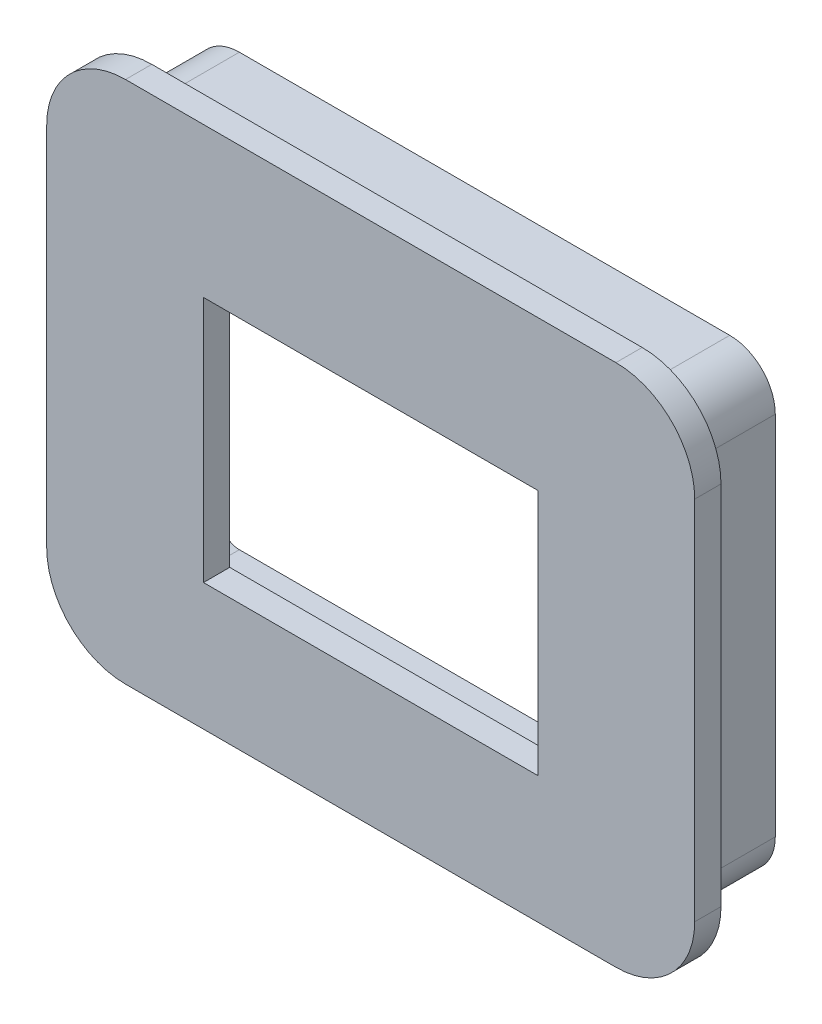
ISO-10303-21;
HEADER;
FILE_DESCRIPTION(('STEP AP214'),'2;1');
FILE_NAME('part.step','',(''),(''),'','','');
FILE_SCHEMA(('AUTOMOTIVE_DESIGN { 1 0 10303 214 1 1 1 1 }'));
ENDSEC;
DATA;
#1=APPLICATION_CONTEXT('core data for automotive mechanical design processes');
#2=APPLICATION_PROTOCOL_DEFINITION('international standard','automotive_design',2000,#1);
#3=PRODUCT_CONTEXT('',#1,'mechanical');
#4=PRODUCT('Part','Part','',(#3));
#5=PRODUCT_RELATED_PRODUCT_CATEGORY('part','',(#4));
#6=PRODUCT_DEFINITION_FORMATION('','',#4);
#7=PRODUCT_DEFINITION_CONTEXT('part definition',#1,'design');
#8=PRODUCT_DEFINITION('design','',#6,#7);
#9=PRODUCT_DEFINITION_SHAPE('','',#8);
#10=(LENGTH_UNIT() NAMED_UNIT(*) SI_UNIT(.MILLI.,.METRE.));
#11=(NAMED_UNIT(*) PLANE_ANGLE_UNIT() SI_UNIT($,.RADIAN.));
#12=(NAMED_UNIT(*) SI_UNIT($,.STERADIAN.) SOLID_ANGLE_UNIT());
#13=UNCERTAINTY_MEASURE_WITH_UNIT(LENGTH_MEASURE(1.E-05),#10,'distance_accuracy_value','');
#14=(GEOMETRIC_REPRESENTATION_CONTEXT(3) GLOBAL_UNCERTAINTY_ASSIGNED_CONTEXT((#13)) GLOBAL_UNIT_ASSIGNED_CONTEXT((#10,
#11,#12)) REPRESENTATION_CONTEXT('',''));
#15=CARTESIAN_POINT('',(0.,0.,0.));
#16=DIRECTION('',(0.,0.,1.));
#17=DIRECTION('',(1.,0.,0.));
#18=AXIS2_PLACEMENT_3D('',#15,#16,#17);
#19=CARTESIAN_POINT('',(-25.2326550947052,21.0000000000001,-5.));
#20=DIRECTION('',(0.,1.,0.));
#21=DIRECTION('',(0.,0.,1.));
#22=AXIS2_PLACEMENT_3D('',#19,#20,#21);
#23=PLANE('',#22);
#24=DIRECTION('',(-1.,0.,0.));
#25=VECTOR('',#24,1.);
#26=CARTESIAN_POINT('',(-25.2326550947052,21.0000000000001,0.));
#27=LINE('',#26,#25);
#28=CARTESIAN_POINT('',(-6.24500451351651E-13,21.0000000000001,0.));
#29=VERTEX_POINT('',#28);
#30=CARTESIAN_POINT('',(-28.0000000000006,21.0000000000001,0.));
#31=VERTEX_POINT('',#30);
#32=EDGE_CURVE('E235',#29,#31,#27,.T.);
#33=ORIENTED_EDGE('',*,*,#32,.F.);
#34=DIRECTION('',(0.,0.,1.));
#35=VECTOR('',#34,1.);
#36=CARTESIAN_POINT('',(-6.24500451351651E-13,21.0000000000001,-5.));
#37=LINE('',#36,#35);
#38=CARTESIAN_POINT('',(-6.24500451351651E-13,21.0000000000001,-5.));
#39=VERTEX_POINT('',#38);
#40=EDGE_CURVE('E12',#39,#29,#37,.T.);
#41=ORIENTED_EDGE('',*,*,#40,.F.);
#42=DIRECTION('',(-1.,0.,0.));
#43=VECTOR('',#42,1.);
#44=CARTESIAN_POINT('',(-25.2326550947052,21.0000000000001,-5.));
#45=LINE('',#44,#43);
#46=CARTESIAN_POINT('',(-28.0000000000006,21.0000000000001,-5.));
#47=VERTEX_POINT('',#46);
#48=EDGE_CURVE('E231',#39,#47,#45,.T.);
#49=ORIENTED_EDGE('',*,*,#48,.T.);
#50=DIRECTION('',(0.,0.,1.));
#51=VECTOR('',#50,1.);
#52=CARTESIAN_POINT('',(-28.0000000000006,21.0000000000001,-5.));
#53=LINE('',#52,#51);
#54=EDGE_CURVE('E51',#47,#31,#53,.T.);
#55=ORIENTED_EDGE('',*,*,#54,.T.);
#56=EDGE_LOOP('',(#33,#41,#49,#55));
#57=FACE_BOUND('',#56,.T.);
#58=ADVANCED_FACE('F47',(#57),#23,.T.);
#59=CARTESIAN_POINT('',(-6.1409211049579E-13,18.4000000000001,-5.));
#60=DIRECTION('',(0.,0.,1.));
#61=DIRECTION('',(1.,0.,0.));
#62=AXIS2_PLACEMENT_3D('',#59,#60,#61);
#63=CYLINDRICAL_SURFACE('',#62,2.6);
#64=CARTESIAN_POINT('',(-6.1409211049579E-13,18.4000000000001,0.));
#65=DIRECTION('',(0.,0.,1.));
#66=DIRECTION('',(1.,0.,0.));
#67=AXIS2_PLACEMENT_3D('',#64,#65,#66);
#68=CIRCLE('',#67,2.6);
#69=CARTESIAN_POINT('',(2.59999999999939,18.4000000000001,0.));
#70=VERTEX_POINT('',#69);
#71=EDGE_CURVE('E273',#70,#29,#68,.T.);
#72=ORIENTED_EDGE('',*,*,#71,.F.);
#73=DIRECTION('',(0.,0.,1.));
#74=VECTOR('',#73,1.);
#75=CARTESIAN_POINT('',(2.59999999999939,18.4000000000001,-5.));
#76=LINE('',#75,#74);
#77=CARTESIAN_POINT('',(2.59999999999939,18.4000000000001,-5.));
#78=VERTEX_POINT('',#77);
#79=EDGE_CURVE('E56',#78,#70,#76,.T.);
#80=ORIENTED_EDGE('',*,*,#79,.F.);
#81=CARTESIAN_POINT('',(-6.1409211049579E-13,18.4000000000001,-5.));
#82=DIRECTION('',(0.,0.,1.));
#83=DIRECTION('',(1.,0.,0.));
#84=AXIS2_PLACEMENT_3D('',#81,#82,#83);
#85=CIRCLE('',#84,2.6);
#86=EDGE_CURVE('E253',#78,#39,#85,.T.);
#87=ORIENTED_EDGE('',*,*,#86,.T.);
#88=ORIENTED_EDGE('',*,*,#40,.T.);
#89=EDGE_LOOP('',(#72,#80,#87,#88));
#90=FACE_BOUND('',#89,.T.);
#91=ADVANCED_FACE('F298',(#90),#63,.T.);
#92=CARTESIAN_POINT('',(2.59999999999938,-2.49999999999988,-5.));
#93=DIRECTION('',(1.,0.,0.));
#94=DIRECTION('',(0.,1.,0.));
#95=AXIS2_PLACEMENT_3D('',#92,#93,#94);
#96=PLANE('',#95);
#97=DIRECTION('',(0.,1.,0.));
#98=VECTOR('',#97,1.);
#99=CARTESIAN_POINT('',(2.59999999999938,-2.49999999999988,0.));
#100=LINE('',#99,#98);
#101=CARTESIAN_POINT('',(2.59999999999938,-2.49999999999988,0.));
#102=VERTEX_POINT('',#101);
#103=EDGE_CURVE('E270',#102,#70,#100,.T.);
#104=ORIENTED_EDGE('',*,*,#103,.F.);
#105=DIRECTION('',(0.,0.,1.));
#106=VECTOR('',#105,1.);
#107=CARTESIAN_POINT('',(2.59999999999938,-2.49999999999988,-5.));
#108=LINE('',#107,#106);
#109=CARTESIAN_POINT('',(2.59999999999938,-2.49999999999988,-5.));
#110=VERTEX_POINT('',#109);
#111=EDGE_CURVE('E278',#110,#102,#108,.T.);
#112=ORIENTED_EDGE('',*,*,#111,.F.);
#113=DIRECTION('',(0.,1.,0.));
#114=VECTOR('',#113,1.);
#115=CARTESIAN_POINT('',(2.59999999999938,-2.49999999999988,-5.));
#116=LINE('',#115,#114);
#117=EDGE_CURVE('E250',#110,#78,#116,.T.);
#118=ORIENTED_EDGE('',*,*,#117,.T.);
#119=ORIENTED_EDGE('',*,*,#79,.T.);
#120=EDGE_LOOP('',(#104,#112,#118,#119));
#121=FACE_BOUND('',#120,.T.);
#122=ADVANCED_FACE('F303',(#121),#96,.T.);
#123=CARTESIAN_POINT('',(-6.17561557447743E-13,-2.49999999999988,-5.));
#124=DIRECTION('',(0.,0.,1.));
#125=DIRECTION('',(1.,0.,0.));
#126=AXIS2_PLACEMENT_3D('',#123,#124,#125);
#127=CYLINDRICAL_SURFACE('',#126,2.6);
#128=CARTESIAN_POINT('',(-6.17561557447743E-13,-2.49999999999988,0.));
#129=DIRECTION('',(0.,0.,1.));
#130=DIRECTION('',(1.,0.,0.));
#131=AXIS2_PLACEMENT_3D('',#128,#129,#130);
#132=CIRCLE('',#131,2.6);
#133=CARTESIAN_POINT('',(-6.38822544720394E-13,-5.09999999999988,0.));
#134=VERTEX_POINT('',#133);
#135=EDGE_CURVE('E267',#134,#102,#132,.T.);
#136=ORIENTED_EDGE('',*,*,#135,.F.);
#137=DIRECTION('',(0.,0.,1.));
#138=VECTOR('',#137,1.);
#139=CARTESIAN_POINT('',(-6.38822544720394E-13,-5.09999999999988,-5.));
#140=LINE('',#139,#138);
#141=CARTESIAN_POINT('',(-6.38822544720394E-13,-5.09999999999988,-5.));
#142=VERTEX_POINT('',#141);
#143=EDGE_CURVE('E280',#142,#134,#140,.T.);
#144=ORIENTED_EDGE('',*,*,#143,.F.);
#145=CARTESIAN_POINT('',(-6.17561557447743E-13,-2.49999999999988,-5.));
#146=DIRECTION('',(0.,0.,1.));
#147=DIRECTION('',(1.,0.,0.));
#148=AXIS2_PLACEMENT_3D('',#145,#146,#147);
#149=CIRCLE('',#148,2.6);
#150=EDGE_CURVE('E247',#142,#110,#149,.T.);
#151=ORIENTED_EDGE('',*,*,#150,.T.);
#152=ORIENTED_EDGE('',*,*,#111,.T.);
#153=EDGE_LOOP('',(#136,#144,#151,#152));
#154=FACE_BOUND('',#153,.T.);
#155=ADVANCED_FACE('F306',(#154),#127,.T.);
#156=CARTESIAN_POINT('',(-28.0000000000006,-5.09999999999988,-5.));
#157=DIRECTION('',(0.,-1.,0.));
#158=DIRECTION('',(1.,0.,0.));
#159=AXIS2_PLACEMENT_3D('',#156,#157,#158);
#160=PLANE('',#159);
#161=DIRECTION('',(1.,0.,0.));
#162=VECTOR('',#161,1.);
#163=CARTESIAN_POINT('',(-28.0000000000006,-5.09999999999988,0.));
#164=LINE('',#163,#162);
#165=CARTESIAN_POINT('',(-28.0000000000006,-5.09999999999988,0.));
#166=VERTEX_POINT('',#165);
#167=EDGE_CURVE('E264',#166,#134,#164,.T.);
#168=ORIENTED_EDGE('',*,*,#167,.F.);
#169=DIRECTION('',(0.,0.,1.));
#170=VECTOR('',#169,1.);
#171=CARTESIAN_POINT('',(-28.0000000000006,-5.09999999999988,-5.));
#172=LINE('',#171,#170);
#173=CARTESIAN_POINT('',(-28.0000000000006,-5.09999999999988,-5.));
#174=VERTEX_POINT('',#173);
#175=EDGE_CURVE('E282',#174,#166,#172,.T.);
#176=ORIENTED_EDGE('',*,*,#175,.F.);
#177=DIRECTION('',(1.,0.,0.));
#178=VECTOR('',#177,1.);
#179=CARTESIAN_POINT('',(-28.0000000000006,-5.09999999999988,-5.));
#180=LINE('',#179,#178);
#181=EDGE_CURVE('E244',#174,#142,#180,.T.);
#182=ORIENTED_EDGE('',*,*,#181,.T.);
#183=ORIENTED_EDGE('',*,*,#143,.T.);
#184=EDGE_LOOP('',(#168,#176,#182,#183));
#185=FACE_BOUND('',#184,.T.);
#186=ADVANCED_FACE('F311',(#185),#160,.T.);
#187=CARTESIAN_POINT('',(-28.0000000000006,-2.49999999999988,-5.));
#188=DIRECTION('',(0.,0.,1.));
#189=DIRECTION('',(1.,0.,0.));
#190=AXIS2_PLACEMENT_3D('',#187,#188,#189);
#191=CYLINDRICAL_SURFACE('',#190,2.6);
#192=CARTESIAN_POINT('',(-28.0000000000006,-2.49999999999988,0.));
#193=DIRECTION('',(0.,0.,1.));
#194=DIRECTION('',(1.,0.,0.));
#195=AXIS2_PLACEMENT_3D('',#192,#193,#194);
#196=CIRCLE('',#195,2.6);
#197=CARTESIAN_POINT('',(-30.6000000000006,-2.49999999999988,0.));
#198=VERTEX_POINT('',#197);
#199=EDGE_CURVE('E261',#198,#166,#196,.T.);
#200=ORIENTED_EDGE('',*,*,#199,.F.);
#201=DIRECTION('',(0.,0.,1.));
#202=VECTOR('',#201,1.);
#203=CARTESIAN_POINT('',(-30.6000000000006,-2.49999999999988,-5.));
#204=LINE('',#203,#202);
#205=CARTESIAN_POINT('',(-30.6000000000006,-2.49999999999988,-5.));
#206=VERTEX_POINT('',#205);
#207=EDGE_CURVE('E284',#206,#198,#204,.T.);
#208=ORIENTED_EDGE('',*,*,#207,.F.);
#209=CARTESIAN_POINT('',(-28.0000000000006,-2.49999999999988,-5.));
#210=DIRECTION('',(0.,0.,1.));
#211=DIRECTION('',(1.,0.,0.));
#212=AXIS2_PLACEMENT_3D('',#209,#210,#211);
#213=CIRCLE('',#212,2.6);
#214=EDGE_CURVE('E241',#206,#174,#213,.T.);
#215=ORIENTED_EDGE('',*,*,#214,.T.);
#216=ORIENTED_EDGE('',*,*,#175,.T.);
#217=EDGE_LOOP('',(#200,#208,#215,#216));
#218=FACE_BOUND('',#217,.T.);
#219=ADVANCED_FACE('F314',(#218),#191,.T.);
#220=CARTESIAN_POINT('',(-30.6000000000006,18.4000000000001,-5.));
#221=DIRECTION('',(-1.,0.,0.));
#222=DIRECTION('',(0.,-1.,0.));
#223=AXIS2_PLACEMENT_3D('',#220,#221,#222);
#224=PLANE('',#223);
#225=DIRECTION('',(0.,-1.,0.));
#226=VECTOR('',#225,1.);
#227=CARTESIAN_POINT('',(-30.6000000000006,18.4000000000001,0.));
#228=LINE('',#227,#226);
#229=CARTESIAN_POINT('',(-30.6000000000006,18.4000000000001,0.));
#230=VERTEX_POINT('',#229);
#231=EDGE_CURVE('E258',#230,#198,#228,.T.);
#232=ORIENTED_EDGE('',*,*,#231,.F.);
#233=DIRECTION('',(0.,0.,1.));
#234=VECTOR('',#233,1.);
#235=CARTESIAN_POINT('',(-30.6000000000006,18.4000000000001,-5.));
#236=LINE('',#235,#234);
#237=CARTESIAN_POINT('',(-30.6000000000006,18.4000000000001,-5.));
#238=VERTEX_POINT('',#237);
#239=EDGE_CURVE('E285',#238,#230,#236,.T.);
#240=ORIENTED_EDGE('',*,*,#239,.F.);
#241=DIRECTION('',(0.,-1.,0.));
#242=VECTOR('',#241,1.);
#243=CARTESIAN_POINT('',(-30.6000000000006,18.4000000000001,-5.));
#244=LINE('',#243,#242);
#245=EDGE_CURVE('E238',#238,#206,#244,.T.);
#246=ORIENTED_EDGE('',*,*,#245,.T.);
#247=ORIENTED_EDGE('',*,*,#207,.T.);
#248=EDGE_LOOP('',(#232,#240,#246,#247));
#249=FACE_BOUND('',#248,.T.);
#250=ADVANCED_FACE('F317',(#249),#224,.T.);
#251=CARTESIAN_POINT('',(-28.0000000000006,18.4000000000001,-5.));
#252=DIRECTION('',(0.,0.,1.));
#253=DIRECTION('',(1.,0.,0.));
#254=AXIS2_PLACEMENT_3D('',#251,#252,#253);
#255=CYLINDRICAL_SURFACE('',#254,2.6);
#256=CARTESIAN_POINT('',(-28.0000000000006,18.4000000000001,0.));
#257=DIRECTION('',(0.,0.,1.));
#258=DIRECTION('',(1.,0.,0.));
#259=AXIS2_PLACEMENT_3D('',#256,#257,#258);
#260=CIRCLE('',#259,2.6);
#261=EDGE_CURVE('E219',#31,#230,#260,.T.);
#262=ORIENTED_EDGE('',*,*,#261,.F.);
#263=ORIENTED_EDGE('',*,*,#54,.F.);
#264=CARTESIAN_POINT('',(-28.0000000000006,18.4000000000001,-5.));
#265=DIRECTION('',(0.,0.,1.));
#266=DIRECTION('',(1.,0.,0.));
#267=AXIS2_PLACEMENT_3D('',#264,#265,#266);
#268=CIRCLE('',#267,2.6);
#269=EDGE_CURVE('E234',#47,#238,#268,.T.);
#270=ORIENTED_EDGE('',*,*,#269,.T.);
#271=ORIENTED_EDGE('',*,*,#239,.T.);
#272=EDGE_LOOP('',(#262,#263,#270,#271));
#273=FACE_BOUND('',#272,.T.);
#274=ADVANCED_FACE('F49',(#273),#255,.T.);
#275=CARTESIAN_POINT('',(-28.0000000000006,18.4000000000001,-5.));
#276=DIRECTION('',(0.,0.,1.));
#277=DIRECTION('',(1.,0.,0.));
#278=AXIS2_PLACEMENT_3D('',#275,#276,#277);
#279=PLANE('',#278);
#280=DIRECTION('',(-1.,0.,0.));
#281=VECTOR('',#280,1.);
#282=CARTESIAN_POINT('',(-3.21777585815503,19.5000000000001,-5.));
#283=LINE('',#282,#281);
#284=CARTESIAN_POINT('',(-6.17932739968517E-13,19.5000000000001,-5.));
#285=VERTEX_POINT('',#284);
#286=CARTESIAN_POINT('',(-28.0000000000006,19.5000000000001,-5.));
#287=VERTEX_POINT('',#286);
#288=EDGE_CURVE('E170',#285,#287,#283,.T.);
#289=ORIENTED_EDGE('',*,*,#288,.T.);
#290=CARTESIAN_POINT('',(-28.0000000000006,18.4000000000001,-5.));
#291=DIRECTION('',(0.,0.,1.));
#292=DIRECTION('',(1.,0.,0.));
#293=AXIS2_PLACEMENT_3D('',#290,#291,#292);
#294=CIRCLE('',#293,1.1);
#295=CARTESIAN_POINT('',(-29.1000000000006,18.4000000000001,-5.));
#296=VERTEX_POINT('',#295);
#297=EDGE_CURVE('E164',#287,#296,#294,.T.);
#298=ORIENTED_EDGE('',*,*,#297,.T.);
#299=DIRECTION('',(0.,-1.,0.));
#300=VECTOR('',#299,1.);
#301=CARTESIAN_POINT('',(-29.1000000000006,-2.49999999999988,-5.));
#302=LINE('',#301,#300);
#303=CARTESIAN_POINT('',(-29.1000000000006,-2.49999999999988,-5.));
#304=VERTEX_POINT('',#303);
#305=EDGE_CURVE('E173',#296,#304,#302,.T.);
#306=ORIENTED_EDGE('',*,*,#305,.T.);
#307=CARTESIAN_POINT('',(-28.0000000000006,-2.49999999999988,-5.));
#308=DIRECTION('',(0.,0.,1.));
#309=DIRECTION('',(1.,0.,0.));
#310=AXIS2_PLACEMENT_3D('',#307,#308,#309);
#311=CIRCLE('',#310,1.1);
#312=CARTESIAN_POINT('',(-28.0000000000006,-3.59999999999988,-5.));
#313=VERTEX_POINT('',#312);
#314=EDGE_CURVE('E64',#304,#313,#311,.T.);
#315=ORIENTED_EDGE('',*,*,#314,.T.);
#316=DIRECTION('',(1.,0.,0.));
#317=VECTOR('',#316,1.);
#318=CARTESIAN_POINT('',(-6.38378239159465E-13,-3.59999999999988,-5.));
#319=LINE('',#318,#317);
#320=CARTESIAN_POINT('',(-6.39257541926346E-13,-3.59999999999988,-5.));
#321=VERTEX_POINT('',#320);
#322=EDGE_CURVE('E188',#313,#321,#319,.T.);
#323=ORIENTED_EDGE('',*,*,#322,.T.);
#324=CARTESIAN_POINT('',(-6.17561557447743E-13,-2.49999999999988,-5.));
#325=DIRECTION('',(0.,0.,1.));
#326=DIRECTION('',(1.,0.,0.));
#327=AXIS2_PLACEMENT_3D('',#324,#325,#326);
#328=CIRCLE('',#327,1.1);
#329=CARTESIAN_POINT('',(1.09999999999938,-2.49999999999988,-5.));
#330=VERTEX_POINT('',#329);
#331=EDGE_CURVE('E191',#321,#330,#328,.T.);
#332=ORIENTED_EDGE('',*,*,#331,.T.);
#333=DIRECTION('',(0.,1.,0.));
#334=VECTOR('',#333,1.);
#335=CARTESIAN_POINT('',(1.09999999999939,18.4000000000001,-5.));
#336=LINE('',#335,#334);
#337=CARTESIAN_POINT('',(1.09999999999939,18.4000000000001,-5.));
#338=VERTEX_POINT('',#337);
#339=EDGE_CURVE('E194',#330,#338,#336,.T.);
#340=ORIENTED_EDGE('',*,*,#339,.T.);
#341=CARTESIAN_POINT('',(-6.1409211049579E-13,18.4000000000001,-5.));
#342=DIRECTION('',(0.,0.,1.));
#343=DIRECTION('',(1.,0.,0.));
#344=AXIS2_PLACEMENT_3D('',#341,#342,#343);
#345=CIRCLE('',#344,1.1);
#346=EDGE_CURVE('E197',#338,#285,#345,.T.);
#347=ORIENTED_EDGE('',*,*,#346,.T.);
#348=EDGE_LOOP('',(#289,#298,#306,#315,#323,#332,#340,#347));
#349=FACE_BOUND('',#348,.T.);
#350=ORIENTED_EDGE('',*,*,#48,.F.);
#351=ORIENTED_EDGE('',*,*,#86,.F.);
#352=ORIENTED_EDGE('',*,*,#117,.F.);
#353=ORIENTED_EDGE('',*,*,#150,.F.);
#354=ORIENTED_EDGE('',*,*,#181,.F.);
#355=ORIENTED_EDGE('',*,*,#214,.F.);
#356=ORIENTED_EDGE('',*,*,#245,.F.);
#357=ORIENTED_EDGE('',*,*,#269,.F.);
#358=EDGE_LOOP('',(#350,#351,#352,#353,#354,#355,#356,#357));
#359=FACE_BOUND('',#358,.T.);
#360=ADVANCED_FACE('F177',(#349,#359),#279,.F.);
#361=CARTESIAN_POINT('',(-28.0000000000006,18.4000000000001,0.));
#362=DIRECTION('',(0.,0.,1.));
#363=DIRECTION('',(1.,0.,0.));
#364=AXIS2_PLACEMENT_3D('',#361,#362,#363);
#365=PLANE('',#364);
#366=CARTESIAN_POINT('',(-28.0000000000006,18.4000000000001,0.));
#367=DIRECTION('',(0.,0.,1.));
#368=DIRECTION('',(1.,0.,0.));
#369=AXIS2_PLACEMENT_3D('',#366,#367,#368);
#370=CIRCLE('',#369,1.1);
#371=CARTESIAN_POINT('',(-28.0000000000006,19.5000000000001,0.));
#372=VERTEX_POINT('',#371);
#373=CARTESIAN_POINT('',(-29.1000000000006,18.4000000000001,0.));
#374=VERTEX_POINT('',#373);
#375=EDGE_CURVE('E72',#372,#374,#370,.T.);
#376=ORIENTED_EDGE('',*,*,#375,.F.);
#377=DIRECTION('',(-1.,0.,0.));
#378=VECTOR('',#377,1.);
#379=CARTESIAN_POINT('',(-28.0000000000006,19.5000000000001,0.));
#380=LINE('',#379,#378);
#381=CARTESIAN_POINT('',(-6.17932739968517E-13,19.5000000000001,0.));
#382=VERTEX_POINT('',#381);
#383=EDGE_CURVE('E181',#382,#372,#380,.T.);
#384=ORIENTED_EDGE('',*,*,#383,.F.);
#385=CARTESIAN_POINT('',(-6.1409211049579E-13,18.4000000000001,0.));
#386=DIRECTION('',(0.,0.,1.));
#387=DIRECTION('',(1.,0.,0.));
#388=AXIS2_PLACEMENT_3D('',#385,#386,#387);
#389=CIRCLE('',#388,1.1);
#390=CARTESIAN_POINT('',(1.09999999999939,18.4000000000001,0.));
#391=VERTEX_POINT('',#390);
#392=EDGE_CURVE('E184',#391,#382,#389,.T.);
#393=ORIENTED_EDGE('',*,*,#392,.F.);
#394=DIRECTION('',(0.,1.,0.));
#395=VECTOR('',#394,1.);
#396=CARTESIAN_POINT('',(1.09999999999939,18.4000000000001,0.));
#397=LINE('',#396,#395);
#398=CARTESIAN_POINT('',(1.09999999999938,-2.49999999999988,0.));
#399=VERTEX_POINT('',#398);
#400=EDGE_CURVE('E212',#399,#391,#397,.T.);
#401=ORIENTED_EDGE('',*,*,#400,.F.);
#402=CARTESIAN_POINT('',(-6.17561557447743E-13,-2.49999999999988,0.));
#403=DIRECTION('',(0.,0.,1.));
#404=DIRECTION('',(1.,0.,0.));
#405=AXIS2_PLACEMENT_3D('',#402,#403,#404);
#406=CIRCLE('',#405,1.1);
#407=CARTESIAN_POINT('',(-6.39257541926346E-13,-3.59999999999988,0.));
#408=VERTEX_POINT('',#407);
#409=EDGE_CURVE('E209',#408,#399,#406,.T.);
#410=ORIENTED_EDGE('',*,*,#409,.F.);
#411=DIRECTION('',(1.,0.,0.));
#412=VECTOR('',#411,1.);
#413=CARTESIAN_POINT('',(-6.38378239159465E-13,-3.59999999999988,0.));
#414=LINE('',#413,#412);
#415=CARTESIAN_POINT('',(-28.0000000000006,-3.59999999999988,0.));
#416=VERTEX_POINT('',#415);
#417=EDGE_CURVE('E206',#416,#408,#414,.T.);
#418=ORIENTED_EDGE('',*,*,#417,.F.);
#419=CARTESIAN_POINT('',(-28.0000000000006,-2.49999999999988,0.));
#420=DIRECTION('',(0.,0.,1.));
#421=DIRECTION('',(1.,0.,0.));
#422=AXIS2_PLACEMENT_3D('',#419,#420,#421);
#423=CIRCLE('',#422,1.1);
#424=CARTESIAN_POINT('',(-29.1000000000006,-2.49999999999988,0.));
#425=VERTEX_POINT('',#424);
#426=EDGE_CURVE('E203',#425,#416,#423,.T.);
#427=ORIENTED_EDGE('',*,*,#426,.F.);
#428=DIRECTION('',(0.,-1.,0.));
#429=VECTOR('',#428,1.);
#430=CARTESIAN_POINT('',(-29.1000000000006,-2.49999999999988,0.));
#431=LINE('',#430,#429);
#432=EDGE_CURVE('E201',#374,#425,#431,.T.);
#433=ORIENTED_EDGE('',*,*,#432,.F.);
#434=EDGE_LOOP('',(#376,#384,#393,#401,#410,#418,#427,#433));
#435=FACE_BOUND('',#434,.T.);
#436=ORIENTED_EDGE('',*,*,#32,.T.);
#437=ORIENTED_EDGE('',*,*,#261,.T.);
#438=ORIENTED_EDGE('',*,*,#231,.T.);
#439=ORIENTED_EDGE('',*,*,#199,.T.);
#440=ORIENTED_EDGE('',*,*,#167,.T.);
#441=ORIENTED_EDGE('',*,*,#135,.T.);
#442=ORIENTED_EDGE('',*,*,#103,.T.);
#443=ORIENTED_EDGE('',*,*,#71,.T.);
#444=EDGE_LOOP('',(#436,#437,#438,#439,#440,#441,#442,#443));
#445=FACE_BOUND('',#444,.T.);
#446=ADVANCED_FACE('F294',(#435,#445),#365,.T.);
#447=CARTESIAN_POINT('',(-28.0000000000006,18.4000000000001,-5.));
#448=DIRECTION('',(0.,0.,1.));
#449=DIRECTION('',(1.,0.,0.));
#450=AXIS2_PLACEMENT_3D('',#447,#448,#449);
#451=CYLINDRICAL_SURFACE('',#450,1.1);
#452=ORIENTED_EDGE('',*,*,#375,.T.);
#453=DIRECTION('',(0.,0.,1.));
#454=VECTOR('',#453,1.);
#455=CARTESIAN_POINT('',(-29.1000000000006,18.4000000000001,-5.));
#456=LINE('',#455,#454);
#457=EDGE_CURVE('E160',#296,#374,#456,.T.);
#458=ORIENTED_EDGE('',*,*,#457,.F.);
#459=ORIENTED_EDGE('',*,*,#297,.F.);
#460=DIRECTION('',(0.,0.,1.));
#461=VECTOR('',#460,1.);
#462=CARTESIAN_POINT('',(-28.0000000000006,19.5000000000001,-5.));
#463=LINE('',#462,#461);
#464=EDGE_CURVE('E217',#287,#372,#463,.T.);
#465=ORIENTED_EDGE('',*,*,#464,.T.);
#466=EDGE_LOOP('',(#452,#458,#459,#465));
#467=FACE_BOUND('',#466,.T.);
#468=ADVANCED_FACE('F162',(#467),#451,.F.);
#469=CARTESIAN_POINT('',(-28.0000000000006,19.5000000000001,-5.));
#470=DIRECTION('',(0.,1.,0.));
#471=DIRECTION('',(-1.,0.,0.));
#472=AXIS2_PLACEMENT_3D('',#469,#470,#471);
#473=PLANE('',#472);
#474=ORIENTED_EDGE('',*,*,#383,.T.);
#475=ORIENTED_EDGE('',*,*,#464,.F.);
#476=ORIENTED_EDGE('',*,*,#288,.F.);
#477=DIRECTION('',(0.,0.,1.));
#478=VECTOR('',#477,1.);
#479=CARTESIAN_POINT('',(-6.17932739968517E-13,19.5000000000001,-5.));
#480=LINE('',#479,#478);
#481=EDGE_CURVE('E220',#285,#382,#480,.T.);
#482=ORIENTED_EDGE('',*,*,#481,.T.);
#483=EDGE_LOOP('',(#474,#475,#476,#482));
#484=FACE_BOUND('',#483,.T.);
#485=ADVANCED_FACE('F380',(#484),#473,.F.);
#486=CARTESIAN_POINT('',(-6.1409211049579E-13,18.4000000000001,-5.));
#487=DIRECTION('',(0.,0.,1.));
#488=DIRECTION('',(1.,0.,0.));
#489=AXIS2_PLACEMENT_3D('',#486,#487,#488);
#490=CYLINDRICAL_SURFACE('',#489,1.1);
#491=ORIENTED_EDGE('',*,*,#392,.T.);
#492=ORIENTED_EDGE('',*,*,#481,.F.);
#493=ORIENTED_EDGE('',*,*,#346,.F.);
#494=DIRECTION('',(0.,0.,1.));
#495=VECTOR('',#494,1.);
#496=CARTESIAN_POINT('',(1.09999999999939,18.4000000000001,-5.));
#497=LINE('',#496,#495);
#498=EDGE_CURVE('E222',#338,#391,#497,.T.);
#499=ORIENTED_EDGE('',*,*,#498,.T.);
#500=EDGE_LOOP('',(#491,#492,#493,#499));
#501=FACE_BOUND('',#500,.T.);
#502=ADVANCED_FACE('F390',(#501),#490,.F.);
#503=CARTESIAN_POINT('',(1.09999999999939,18.4000000000001,-5.));
#504=DIRECTION('',(1.,0.,0.));
#505=DIRECTION('',(0.,1.,0.));
#506=AXIS2_PLACEMENT_3D('',#503,#504,#505);
#507=PLANE('',#506);
#508=ORIENTED_EDGE('',*,*,#400,.T.);
#509=ORIENTED_EDGE('',*,*,#498,.F.);
#510=ORIENTED_EDGE('',*,*,#339,.F.);
#511=DIRECTION('',(0.,0.,1.));
#512=VECTOR('',#511,1.);
#513=CARTESIAN_POINT('',(1.09999999999938,-2.49999999999988,-5.));
#514=LINE('',#513,#512);
#515=EDGE_CURVE('E224',#330,#399,#514,.T.);
#516=ORIENTED_EDGE('',*,*,#515,.T.);
#517=EDGE_LOOP('',(#508,#509,#510,#516));
#518=FACE_BOUND('',#517,.T.);
#519=ADVANCED_FACE('F401',(#518),#507,.F.);
#520=CARTESIAN_POINT('',(-6.17561557447743E-13,-2.49999999999988,-5.));
#521=DIRECTION('',(0.,0.,1.));
#522=DIRECTION('',(1.,0.,0.));
#523=AXIS2_PLACEMENT_3D('',#520,#521,#522);
#524=CYLINDRICAL_SURFACE('',#523,1.1);
#525=ORIENTED_EDGE('',*,*,#409,.T.);
#526=ORIENTED_EDGE('',*,*,#515,.F.);
#527=ORIENTED_EDGE('',*,*,#331,.F.);
#528=DIRECTION('',(0.,0.,1.));
#529=VECTOR('',#528,1.);
#530=CARTESIAN_POINT('',(-6.39257541926346E-13,-3.59999999999988,-5.));
#531=LINE('',#530,#529);
#532=EDGE_CURVE('E226',#321,#408,#531,.T.);
#533=ORIENTED_EDGE('',*,*,#532,.T.);
#534=EDGE_LOOP('',(#525,#526,#527,#533));
#535=FACE_BOUND('',#534,.T.);
#536=ADVANCED_FACE('F411',(#535),#524,.F.);
#537=CARTESIAN_POINT('',(-6.38378239159465E-13,-3.59999999999988,-5.));
#538=DIRECTION('',(0.,-1.,0.));
#539=DIRECTION('',(1.,0.,0.));
#540=AXIS2_PLACEMENT_3D('',#537,#538,#539);
#541=PLANE('',#540);
#542=ORIENTED_EDGE('',*,*,#417,.T.);
#543=ORIENTED_EDGE('',*,*,#532,.F.);
#544=ORIENTED_EDGE('',*,*,#322,.F.);
#545=DIRECTION('',(0.,0.,1.));
#546=VECTOR('',#545,1.);
#547=CARTESIAN_POINT('',(-28.0000000000006,-3.59999999999988,-5.));
#548=LINE('',#547,#546);
#549=EDGE_CURVE('E228',#313,#416,#548,.T.);
#550=ORIENTED_EDGE('',*,*,#549,.T.);
#551=EDGE_LOOP('',(#542,#543,#544,#550));
#552=FACE_BOUND('',#551,.T.);
#553=ADVANCED_FACE('F421',(#552),#541,.F.);
#554=CARTESIAN_POINT('',(-28.0000000000006,-2.49999999999988,-5.));
#555=DIRECTION('',(0.,0.,1.));
#556=DIRECTION('',(1.,0.,0.));
#557=AXIS2_PLACEMENT_3D('',#554,#555,#556);
#558=CYLINDRICAL_SURFACE('',#557,1.1);
#559=ORIENTED_EDGE('',*,*,#426,.T.);
#560=ORIENTED_EDGE('',*,*,#549,.F.);
#561=ORIENTED_EDGE('',*,*,#314,.F.);
#562=DIRECTION('',(0.,0.,1.));
#563=VECTOR('',#562,1.);
#564=CARTESIAN_POINT('',(-29.1000000000006,-2.49999999999988,-5.));
#565=LINE('',#564,#563);
#566=EDGE_CURVE('E169',#304,#425,#565,.T.);
#567=ORIENTED_EDGE('',*,*,#566,.T.);
#568=EDGE_LOOP('',(#559,#560,#561,#567));
#569=FACE_BOUND('',#568,.T.);
#570=ADVANCED_FACE('F431',(#569),#558,.F.);
#571=CARTESIAN_POINT('',(-29.1000000000006,-2.49999999999988,-5.));
#572=DIRECTION('',(-1.,0.,0.));
#573=DIRECTION('',(0.,0.,1.));
#574=AXIS2_PLACEMENT_3D('',#571,#572,#573);
#575=PLANE('',#574);
#576=ORIENTED_EDGE('',*,*,#432,.T.);
#577=ORIENTED_EDGE('',*,*,#566,.F.);
#578=ORIENTED_EDGE('',*,*,#305,.F.);
#579=ORIENTED_EDGE('',*,*,#457,.T.);
#580=EDGE_LOOP('',(#576,#577,#578,#579));
#581=FACE_BOUND('',#580,.T.);
#582=ADVANCED_FACE('F174',(#581),#575,.F.);
#583=CLOSED_SHELL('',(#58,#91,#122,#155,#186,#219,#250,#274,#360,#446,#468,#485,#502,#519,#536,
#553,#570,#582));
#584=MANIFOLD_SOLID_BREP('B2',#583);
#585=CARTESIAN_POINT('',(0.,18.4,1.5));
#586=DIRECTION('',(0.,0.,-1.));
#587=DIRECTION('',(-1.,0.,0.));
#588=AXIS2_PLACEMENT_3D('',#585,#586,#587);
#589=CYLINDRICAL_SURFACE('',#588,4.5);
#590=CARTESIAN_POINT('',(0.,18.4,0.));
#591=DIRECTION('',(0.,0.,1.));
#592=DIRECTION('',(1.,0.,0.));
#593=AXIS2_PLACEMENT_3D('',#590,#591,#592);
#594=CIRCLE('',#593,4.5);
#595=CARTESIAN_POINT('',(4.5,18.4,0.));
#596=VERTEX_POINT('',#595);
#597=CARTESIAN_POINT('',(0.,22.9,0.));
#598=VERTEX_POINT('',#597);
#599=EDGE_CURVE('E615',#596,#598,#594,.T.);
#600=ORIENTED_EDGE('',*,*,#599,.T.);
#601=DIRECTION('',(0.,0.,-1.));
#602=VECTOR('',#601,1.);
#603=CARTESIAN_POINT('',(0.,22.9,1.5));
#604=LINE('',#603,#602);
#605=CARTESIAN_POINT('',(0.,22.9,1.5));
#606=VERTEX_POINT('',#605);
#607=EDGE_CURVE('E45',#606,#598,#604,.T.);
#608=ORIENTED_EDGE('',*,*,#607,.F.);
#609=CARTESIAN_POINT('',(0.,18.4,1.5));
#610=DIRECTION('',(0.,0.,1.));
#611=DIRECTION('',(1.,0.,0.));
#612=AXIS2_PLACEMENT_3D('',#609,#610,#611);
#613=CIRCLE('',#612,4.5);
#614=CARTESIAN_POINT('',(4.5,18.4,1.5));
#615=VERTEX_POINT('',#614);
#616=EDGE_CURVE('E617',#615,#606,#613,.T.);
#617=ORIENTED_EDGE('',*,*,#616,.F.);
#618=DIRECTION('',(0.,0.,-1.));
#619=VECTOR('',#618,1.);
#620=CARTESIAN_POINT('',(4.5,18.4,1.5));
#621=LINE('',#620,#619);
#622=EDGE_CURVE('E635',#615,#596,#621,.T.);
#623=ORIENTED_EDGE('',*,*,#622,.T.);
#624=EDGE_LOOP('',(#600,#608,#617,#623));
#625=FACE_BOUND('',#624,.T.);
#626=ADVANCED_FACE('F497',(#625),#589,.T.);
#627=CARTESIAN_POINT('',(0.,22.9,1.5));
#628=DIRECTION('',(0.,-1.,0.));
#629=DIRECTION('',(0.,0.,-1.));
#630=AXIS2_PLACEMENT_3D('',#627,#628,#629);
#631=PLANE('',#630);
#632=DIRECTION('',(-1.,0.,0.));
#633=VECTOR('',#632,1.);
#634=CARTESIAN_POINT('',(0.,22.9,0.));
#635=LINE('',#634,#633);
#636=CARTESIAN_POINT('',(-28.,22.9,0.));
#637=VERTEX_POINT('',#636);
#638=EDGE_CURVE('E638',#598,#637,#635,.T.);
#639=ORIENTED_EDGE('',*,*,#638,.T.);
#640=DIRECTION('',(0.,0.,-1.));
#641=VECTOR('',#640,1.);
#642=CARTESIAN_POINT('',(-28.,22.9,1.5));
#643=LINE('',#642,#641);
#644=CARTESIAN_POINT('',(-28.,22.9,1.5));
#645=VERTEX_POINT('',#644);
#646=EDGE_CURVE('E504',#645,#637,#643,.T.);
#647=ORIENTED_EDGE('',*,*,#646,.F.);
#648=DIRECTION('',(-1.,0.,0.));
#649=VECTOR('',#648,1.);
#650=CARTESIAN_POINT('',(0.,22.9,1.5));
#651=LINE('',#650,#649);
#652=EDGE_CURVE('E620',#606,#645,#651,.T.);
#653=ORIENTED_EDGE('',*,*,#652,.F.);
#654=ORIENTED_EDGE('',*,*,#607,.T.);
#655=EDGE_LOOP('',(#639,#647,#653,#654));
#656=FACE_BOUND('',#655,.T.);
#657=ADVANCED_FACE('F693',(#656),#631,.F.);
#658=CARTESIAN_POINT('',(-28.,18.4,1.5));
#659=DIRECTION('',(0.,0.,-1.));
#660=DIRECTION('',(-1.,0.,0.));
#661=AXIS2_PLACEMENT_3D('',#658,#659,#660);
#662=CYLINDRICAL_SURFACE('',#661,4.5);
#663=CARTESIAN_POINT('',(-28.,18.4,0.));
#664=DIRECTION('',(0.,0.,1.));
#665=DIRECTION('',(1.,0.,0.));
#666=AXIS2_PLACEMENT_3D('',#663,#664,#665);
#667=CIRCLE('',#666,4.5);
#668=CARTESIAN_POINT('',(-32.5,18.4,0.));
#669=VERTEX_POINT('',#668);
#670=EDGE_CURVE('E640',#637,#669,#667,.T.);
#671=ORIENTED_EDGE('',*,*,#670,.T.);
#672=DIRECTION('',(0.,0.,-1.));
#673=VECTOR('',#672,1.);
#674=CARTESIAN_POINT('',(-32.5,18.4,1.5));
#675=LINE('',#674,#673);
#676=CARTESIAN_POINT('',(-32.5,18.4,1.5));
#677=VERTEX_POINT('',#676);
#678=EDGE_CURVE('E665',#677,#669,#675,.T.);
#679=ORIENTED_EDGE('',*,*,#678,.F.);
#680=CARTESIAN_POINT('',(-28.,18.4,1.5));
#681=DIRECTION('',(0.,0.,1.));
#682=DIRECTION('',(1.,0.,0.));
#683=AXIS2_PLACEMENT_3D('',#680,#681,#682);
#684=CIRCLE('',#683,4.5);
#685=EDGE_CURVE('E623',#645,#677,#684,.T.);
#686=ORIENTED_EDGE('',*,*,#685,.F.);
#687=ORIENTED_EDGE('',*,*,#646,.T.);
#688=EDGE_LOOP('',(#671,#679,#686,#687));
#689=FACE_BOUND('',#688,.T.);
#690=ADVANCED_FACE('F672',(#689),#662,.T.);
#691=CARTESIAN_POINT('',(-32.5,18.4,1.5));
#692=DIRECTION('',(1.,0.,0.));
#693=DIRECTION('',(0.,0.,-1.));
#694=AXIS2_PLACEMENT_3D('',#691,#692,#693);
#695=PLANE('',#694);
#696=DIRECTION('',(0.,-1.,0.));
#697=VECTOR('',#696,1.);
#698=CARTESIAN_POINT('',(-32.5,18.4,0.));
#699=LINE('',#698,#697);
#700=CARTESIAN_POINT('',(-32.5,-2.5,0.));
#701=VERTEX_POINT('',#700);
#702=EDGE_CURVE('E642',#669,#701,#699,.T.);
#703=ORIENTED_EDGE('',*,*,#702,.T.);
#704=DIRECTION('',(0.,0.,-1.));
#705=VECTOR('',#704,1.);
#706=CARTESIAN_POINT('',(-32.5,-2.5,1.5));
#707=LINE('',#706,#705);
#708=CARTESIAN_POINT('',(-32.5,-2.5,1.5));
#709=VERTEX_POINT('',#708);
#710=EDGE_CURVE('E662',#709,#701,#707,.T.);
#711=ORIENTED_EDGE('',*,*,#710,.F.);
#712=DIRECTION('',(0.,-1.,0.));
#713=VECTOR('',#712,1.);
#714=CARTESIAN_POINT('',(-32.5,18.4,1.5));
#715=LINE('',#714,#713);
#716=EDGE_CURVE('E625',#677,#709,#715,.T.);
#717=ORIENTED_EDGE('',*,*,#716,.F.);
#718=ORIENTED_EDGE('',*,*,#678,.T.);
#719=EDGE_LOOP('',(#703,#711,#717,#718));
#720=FACE_BOUND('',#719,.T.);
#721=ADVANCED_FACE('F683',(#720),#695,.F.);
#722=CARTESIAN_POINT('',(-28.,-2.5,1.5));
#723=DIRECTION('',(0.,0.,-1.));
#724=DIRECTION('',(-1.,0.,0.));
#725=AXIS2_PLACEMENT_3D('',#722,#723,#724);
#726=CYLINDRICAL_SURFACE('',#725,4.5);
#727=CARTESIAN_POINT('',(-28.,-2.5,0.));
#728=DIRECTION('',(0.,0.,1.));
#729=DIRECTION('',(1.,0.,0.));
#730=AXIS2_PLACEMENT_3D('',#727,#728,#729);
#731=CIRCLE('',#730,4.5);
#732=CARTESIAN_POINT('',(-28.,-7.,0.));
#733=VERTEX_POINT('',#732);
#734=EDGE_CURVE('E644',#701,#733,#731,.T.);
#735=ORIENTED_EDGE('',*,*,#734,.T.);
#736=DIRECTION('',(0.,0.,-1.));
#737=VECTOR('',#736,1.);
#738=CARTESIAN_POINT('',(-28.,-7.,1.5));
#739=LINE('',#738,#737);
#740=CARTESIAN_POINT('',(-28.,-7.,1.5));
#741=VERTEX_POINT('',#740);
#742=EDGE_CURVE('E659',#741,#733,#739,.T.);
#743=ORIENTED_EDGE('',*,*,#742,.F.);
#744=CARTESIAN_POINT('',(-28.,-2.5,1.5));
#745=DIRECTION('',(0.,0.,1.));
#746=DIRECTION('',(1.,0.,0.));
#747=AXIS2_PLACEMENT_3D('',#744,#745,#746);
#748=CIRCLE('',#747,4.5);
#749=EDGE_CURVE('E627',#709,#741,#748,.T.);
#750=ORIENTED_EDGE('',*,*,#749,.F.);
#751=ORIENTED_EDGE('',*,*,#710,.T.);
#752=EDGE_LOOP('',(#735,#743,#750,#751));
#753=FACE_BOUND('',#752,.T.);
#754=ADVANCED_FACE('F687',(#753),#726,.T.);
#755=CARTESIAN_POINT('',(-28.,-7.,1.5));
#756=DIRECTION('',(0.,1.,0.));
#757=DIRECTION('',(-1.,0.,0.));
#758=AXIS2_PLACEMENT_3D('',#755,#756,#757);
#759=PLANE('',#758);
#760=DIRECTION('',(1.,0.,0.));
#761=VECTOR('',#760,1.);
#762=CARTESIAN_POINT('',(-28.,-7.,0.));
#763=LINE('',#762,#761);
#764=CARTESIAN_POINT('',(0.,-7.,0.));
#765=VERTEX_POINT('',#764);
#766=EDGE_CURVE('E646',#733,#765,#763,.T.);
#767=ORIENTED_EDGE('',*,*,#766,.T.);
#768=DIRECTION('',(0.,0.,-1.));
#769=VECTOR('',#768,1.);
#770=CARTESIAN_POINT('',(0.,-7.,1.5));
#771=LINE('',#770,#769);
#772=CARTESIAN_POINT('',(0.,-7.,1.5));
#773=VERTEX_POINT('',#772);
#774=EDGE_CURVE('E656',#773,#765,#771,.T.);
#775=ORIENTED_EDGE('',*,*,#774,.F.);
#776=DIRECTION('',(1.,0.,0.));
#777=VECTOR('',#776,1.);
#778=CARTESIAN_POINT('',(-28.,-7.,1.5));
#779=LINE('',#778,#777);
#780=EDGE_CURVE('E629',#741,#773,#779,.T.);
#781=ORIENTED_EDGE('',*,*,#780,.F.);
#782=ORIENTED_EDGE('',*,*,#742,.T.);
#783=EDGE_LOOP('',(#767,#775,#781,#782));
#784=FACE_BOUND('',#783,.T.);
#785=ADVANCED_FACE('F706',(#784),#759,.F.);
#786=CARTESIAN_POINT('',(0.,-2.5,1.5));
#787=DIRECTION('',(0.,0.,-1.));
#788=DIRECTION('',(-1.,0.,0.));
#789=AXIS2_PLACEMENT_3D('',#786,#787,#788);
#790=CYLINDRICAL_SURFACE('',#789,4.5);
#791=CARTESIAN_POINT('',(0.,-2.5,0.));
#792=DIRECTION('',(0.,0.,1.));
#793=DIRECTION('',(1.,0.,0.));
#794=AXIS2_PLACEMENT_3D('',#791,#792,#793);
#795=CIRCLE('',#794,4.5);
#796=CARTESIAN_POINT('',(4.5,-2.5,0.));
#797=VERTEX_POINT('',#796);
#798=EDGE_CURVE('E648',#765,#797,#795,.T.);
#799=ORIENTED_EDGE('',*,*,#798,.T.);
#800=DIRECTION('',(0.,0.,-1.));
#801=VECTOR('',#800,1.);
#802=CARTESIAN_POINT('',(4.5,-2.5,1.5));
#803=LINE('',#802,#801);
#804=CARTESIAN_POINT('',(4.5,-2.5,1.5));
#805=VERTEX_POINT('',#804);
#806=EDGE_CURVE('E653',#805,#797,#803,.T.);
#807=ORIENTED_EDGE('',*,*,#806,.F.);
#808=CARTESIAN_POINT('',(0.,-2.5,1.5));
#809=DIRECTION('',(0.,0.,1.));
#810=DIRECTION('',(1.,0.,0.));
#811=AXIS2_PLACEMENT_3D('',#808,#809,#810);
#812=CIRCLE('',#811,4.5);
#813=EDGE_CURVE('E631',#773,#805,#812,.T.);
#814=ORIENTED_EDGE('',*,*,#813,.F.);
#815=ORIENTED_EDGE('',*,*,#774,.T.);
#816=EDGE_LOOP('',(#799,#807,#814,#815));
#817=FACE_BOUND('',#816,.T.);
#818=ADVANCED_FACE('F704',(#817),#790,.T.);
#819=CARTESIAN_POINT('',(4.5,-2.5,1.5));
#820=DIRECTION('',(-1.,0.,0.));
#821=DIRECTION('',(0.,-1.,0.));
#822=AXIS2_PLACEMENT_3D('',#819,#820,#821);
#823=PLANE('',#822);
#824=DIRECTION('',(0.,1.,0.));
#825=VECTOR('',#824,1.);
#826=CARTESIAN_POINT('',(4.5,-2.5,0.));
#827=LINE('',#826,#825);
#828=EDGE_CURVE('E621',#797,#596,#827,.T.);
#829=ORIENTED_EDGE('',*,*,#828,.T.);
#830=ORIENTED_EDGE('',*,*,#622,.F.);
#831=DIRECTION('',(0.,1.,0.));
#832=VECTOR('',#831,1.);
#833=CARTESIAN_POINT('',(4.5,-2.5,1.5));
#834=LINE('',#833,#832);
#835=EDGE_CURVE('E633',#805,#615,#834,.T.);
#836=ORIENTED_EDGE('',*,*,#835,.F.);
#837=ORIENTED_EDGE('',*,*,#806,.T.);
#838=EDGE_LOOP('',(#829,#830,#836,#837));
#839=FACE_BOUND('',#838,.T.);
#840=ADVANCED_FACE('F699',(#839),#823,.F.);
#841=CARTESIAN_POINT('',(0.,18.4,1.5));
#842=DIRECTION('',(0.,0.,1.));
#843=DIRECTION('',(1.,0.,0.));
#844=AXIS2_PLACEMENT_3D('',#841,#842,#843);
#845=PLANE('',#844);
#846=DIRECTION('',(1.,0.,0.));
#847=VECTOR('',#846,1.);
#848=CARTESIAN_POINT('',(-23.5500000000011,0.250000000002926,1.5));
#849=LINE('',#848,#847);
#850=CARTESIAN_POINT('',(-23.5500000000011,0.250000000002926,1.5));
#851=VERTEX_POINT('',#850);
#852=CARTESIAN_POINT('',(-4.45000000000114,0.250000000002793,1.5));
#853=VERTEX_POINT('',#852);
#854=EDGE_CURVE('E511',#851,#853,#849,.T.);
#855=ORIENTED_EDGE('',*,*,#854,.F.);
#856=DIRECTION('',(0.,-1.,0.));
#857=VECTOR('',#856,1.);
#858=CARTESIAN_POINT('',(-23.550000000001,14.3500000000029,1.5));
#859=LINE('',#858,#857);
#860=CARTESIAN_POINT('',(-23.550000000001,14.3500000000029,1.5));
#861=VERTEX_POINT('',#860);
#862=EDGE_CURVE('E604',#861,#851,#859,.T.);
#863=ORIENTED_EDGE('',*,*,#862,.F.);
#864=DIRECTION('',(-1.,0.,0.));
#865=VECTOR('',#864,1.);
#866=CARTESIAN_POINT('',(-4.45000000000104,14.3500000000028,1.5));
#867=LINE('',#866,#865);
#868=CARTESIAN_POINT('',(-4.45000000000104,14.3500000000028,1.5));
#869=VERTEX_POINT('',#868);
#870=EDGE_CURVE('E588',#869,#861,#867,.T.);
#871=ORIENTED_EDGE('',*,*,#870,.F.);
#872=DIRECTION('',(0.,1.,0.));
#873=VECTOR('',#872,1.);
#874=CARTESIAN_POINT('',(-4.45000000000114,0.250000000002793,1.5));
#875=LINE('',#874,#873);
#876=EDGE_CURVE('E597',#853,#869,#875,.T.);
#877=ORIENTED_EDGE('',*,*,#876,.F.);
#878=EDGE_LOOP('',(#855,#863,#871,#877));
#879=FACE_BOUND('',#878,.T.);
#880=ORIENTED_EDGE('',*,*,#616,.T.);
#881=ORIENTED_EDGE('',*,*,#652,.T.);
#882=ORIENTED_EDGE('',*,*,#685,.T.);
#883=ORIENTED_EDGE('',*,*,#716,.T.);
#884=ORIENTED_EDGE('',*,*,#749,.T.);
#885=ORIENTED_EDGE('',*,*,#780,.T.);
#886=ORIENTED_EDGE('',*,*,#813,.T.);
#887=ORIENTED_EDGE('',*,*,#835,.T.);
#888=EDGE_LOOP('',(#880,#881,#882,#883,#884,#885,#886,#887));
#889=FACE_BOUND('',#888,.T.);
#890=ADVANCED_FACE('F601',(#879,#889),#845,.T.);
#891=CARTESIAN_POINT('',(0.,18.4,0.));
#892=DIRECTION('',(0.,0.,1.));
#893=DIRECTION('',(1.,0.,0.));
#894=AXIS2_PLACEMENT_3D('',#891,#892,#893);
#895=PLANE('',#894);
#896=DIRECTION('',(0.,1.,0.));
#897=VECTOR('',#896,1.);
#898=CARTESIAN_POINT('',(-23.550000000001,14.3500000000029,0.));
#899=LINE('',#898,#897);
#900=CARTESIAN_POINT('',(-23.5500000000011,0.250000000002925,0.));
#901=VERTEX_POINT('',#900);
#902=CARTESIAN_POINT('',(-23.550000000001,14.3500000000029,0.));
#903=VERTEX_POINT('',#902);
#904=EDGE_CURVE('E809',#901,#903,#899,.T.);
#905=ORIENTED_EDGE('',*,*,#904,.F.);
#906=DIRECTION('',(-1.,0.,0.));
#907=VECTOR('',#906,1.);
#908=CARTESIAN_POINT('',(-23.5500000000011,0.250000000002926,0.));
#909=LINE('',#908,#907);
#910=CARTESIAN_POINT('',(-4.45000000000114,0.250000000002793,0.));
#911=VERTEX_POINT('',#910);
#912=EDGE_CURVE('E616',#911,#901,#909,.T.);
#913=ORIENTED_EDGE('',*,*,#912,.F.);
#914=DIRECTION('',(0.,-1.,0.));
#915=VECTOR('',#914,1.);
#916=CARTESIAN_POINT('',(-4.45000000000114,0.250000000002793,0.));
#917=LINE('',#916,#915);
#918=CARTESIAN_POINT('',(-4.45000000000104,14.3500000000028,0.));
#919=VERTEX_POINT('',#918);
#920=EDGE_CURVE('E613',#919,#911,#917,.T.);
#921=ORIENTED_EDGE('',*,*,#920,.F.);
#922=DIRECTION('',(1.,0.,0.));
#923=VECTOR('',#922,1.);
#924=CARTESIAN_POINT('',(-4.45000000000104,14.3500000000028,0.));
#925=LINE('',#924,#923);
#926=EDGE_CURVE('E591',#903,#919,#925,.T.);
#927=ORIENTED_EDGE('',*,*,#926,.F.);
#928=EDGE_LOOP('',(#905,#913,#921,#927));
#929=FACE_BOUND('',#928,.T.);
#930=ORIENTED_EDGE('',*,*,#599,.F.);
#931=ORIENTED_EDGE('',*,*,#828,.F.);
#932=ORIENTED_EDGE('',*,*,#798,.F.);
#933=ORIENTED_EDGE('',*,*,#766,.F.);
#934=ORIENTED_EDGE('',*,*,#734,.F.);
#935=ORIENTED_EDGE('',*,*,#702,.F.);
#936=ORIENTED_EDGE('',*,*,#670,.F.);
#937=ORIENTED_EDGE('',*,*,#638,.F.);
#938=EDGE_LOOP('',(#930,#931,#932,#933,#934,#935,#936,#937));
#939=FACE_BOUND('',#938,.T.);
#940=ADVANCED_FACE('F678',(#929,#939),#895,.F.);
#941=CARTESIAN_POINT('',(-23.5500000000011,0.250000000002926,-23.7406823827793));
#942=DIRECTION('',(0.,-1.,0.));
#943=DIRECTION('',(1.,0.,0.));
#944=AXIS2_PLACEMENT_3D('',#941,#942,#943);
#945=PLANE('',#944);
#946=ORIENTED_EDGE('',*,*,#912,.T.);
#947=DIRECTION('',(0.,0.,1.));
#948=VECTOR('',#947,1.);
#949=CARTESIAN_POINT('',(-23.5500000000011,0.250000000002926,-23.7406823827793));
#950=LINE('',#949,#948);
#951=EDGE_CURVE('E609',#901,#851,#950,.T.);
#952=ORIENTED_EDGE('',*,*,#951,.T.);
#953=ORIENTED_EDGE('',*,*,#854,.T.);
#954=DIRECTION('',(0.,0.,1.));
#955=VECTOR('',#954,1.);
#956=CARTESIAN_POINT('',(-4.45000000000114,0.250000000002793,-23.7406823827793));
#957=LINE('',#956,#955);
#958=EDGE_CURVE('E594',#911,#853,#957,.T.);
#959=ORIENTED_EDGE('',*,*,#958,.F.);
#960=EDGE_LOOP('',(#946,#952,#953,#959));
#961=FACE_BOUND('',#960,.T.);
#962=ADVANCED_FACE('F768',(#961),#945,.F.);
#963=CARTESIAN_POINT('',(-23.550000000001,14.3500000000029,-23.7406823827793));
#964=DIRECTION('',(-1.,0.,0.));
#965=DIRECTION('',(0.,-1.,0.));
#966=AXIS2_PLACEMENT_3D('',#963,#964,#965);
#967=PLANE('',#966);
#968=ORIENTED_EDGE('',*,*,#904,.T.);
#969=DIRECTION('',(0.,0.,1.));
#970=VECTOR('',#969,1.);
#971=CARTESIAN_POINT('',(-23.550000000001,14.3500000000029,-23.7406823827793));
#972=LINE('',#971,#970);
#973=EDGE_CURVE('E593',#903,#861,#972,.T.);
#974=ORIENTED_EDGE('',*,*,#973,.T.);
#975=ORIENTED_EDGE('',*,*,#862,.T.);
#976=ORIENTED_EDGE('',*,*,#951,.F.);
#977=EDGE_LOOP('',(#968,#974,#975,#976));
#978=FACE_BOUND('',#977,.T.);
#979=ADVANCED_FACE('F778',(#978),#967,.F.);
#980=CARTESIAN_POINT('',(-4.45000000000104,14.3500000000028,-23.7406823827793));
#981=DIRECTION('',(0.,1.,0.));
#982=DIRECTION('',(-1.,0.,0.));
#983=AXIS2_PLACEMENT_3D('',#980,#981,#982);
#984=PLANE('',#983);
#985=ORIENTED_EDGE('',*,*,#926,.T.);
#986=DIRECTION('',(0.,0.,1.));
#987=VECTOR('',#986,1.);
#988=CARTESIAN_POINT('',(-4.45000000000104,14.3500000000028,-23.7406823827793));
#989=LINE('',#988,#987);
#990=EDGE_CURVE('E519',#919,#869,#989,.T.);
#991=ORIENTED_EDGE('',*,*,#990,.T.);
#992=ORIENTED_EDGE('',*,*,#870,.T.);
#993=ORIENTED_EDGE('',*,*,#973,.F.);
#994=EDGE_LOOP('',(#985,#991,#992,#993));
#995=FACE_BOUND('',#994,.T.);
#996=ADVANCED_FACE('F585',(#995),#984,.F.);
#997=CARTESIAN_POINT('',(-4.45000000000114,0.250000000002793,-23.7406823827793));
#998=DIRECTION('',(1.,0.,0.));
#999=DIRECTION('',(0.,1.,0.));
#1000=AXIS2_PLACEMENT_3D('',#997,#998,#999);
#1001=PLANE('',#1000);
#1002=ORIENTED_EDGE('',*,*,#920,.T.);
#1003=ORIENTED_EDGE('',*,*,#958,.T.);
#1004=ORIENTED_EDGE('',*,*,#876,.T.);
#1005=ORIENTED_EDGE('',*,*,#990,.F.);
#1006=EDGE_LOOP('',(#1002,#1003,#1004,#1005));
#1007=FACE_BOUND('',#1006,.T.);
#1008=ADVANCED_FACE('F598',(#1007),#1001,.F.);
#1009=CLOSED_SHELL('',(#626,#657,#690,#721,#754,#785,#818,#840,#890,#940,#962,#979,#996,#1008));
#1010=MANIFOLD_SOLID_BREP('B6',#1009);
#1011=ADVANCED_BREP_SHAPE_REPRESENTATION('',(#18,#584,#1010),#14);
#1012=SHAPE_DEFINITION_REPRESENTATION(#9,#1011);
ENDSEC;
END-ISO-10303-21;
